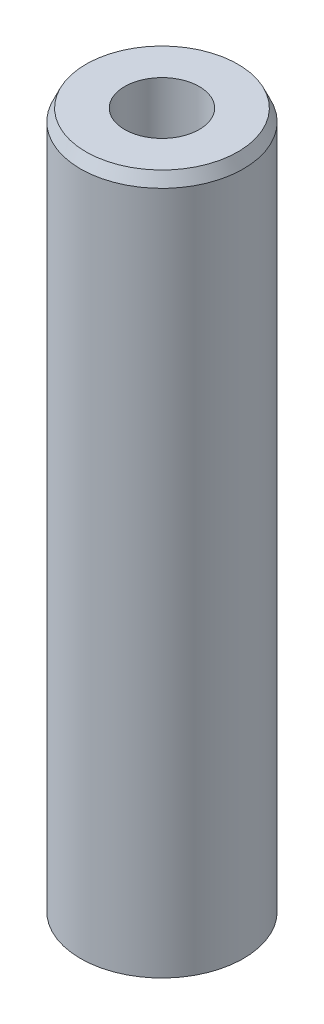
ISO-10303-21;
HEADER;
FILE_DESCRIPTION(('STEP AP214'),'2;1');
FILE_NAME('part.step','',(''),(''),'','','');
FILE_SCHEMA(('AUTOMOTIVE_DESIGN { 1 0 10303 214 1 1 1 1 }'));
ENDSEC;
DATA;
#1=APPLICATION_CONTEXT('core data for automotive mechanical design processes');
#2=APPLICATION_PROTOCOL_DEFINITION('international standard','automotive_design',2000,#1);
#3=PRODUCT_CONTEXT('',#1,'mechanical');
#4=PRODUCT('Part','Part','',(#3));
#5=PRODUCT_RELATED_PRODUCT_CATEGORY('part','',(#4));
#6=PRODUCT_DEFINITION_FORMATION('','',#4);
#7=PRODUCT_DEFINITION_CONTEXT('part definition',#1,'design');
#8=PRODUCT_DEFINITION('design','',#6,#7);
#9=PRODUCT_DEFINITION_SHAPE('','',#8);
#10=(LENGTH_UNIT() NAMED_UNIT(*) SI_UNIT(.MILLI.,.METRE.));
#11=(NAMED_UNIT(*) PLANE_ANGLE_UNIT() SI_UNIT($,.RADIAN.));
#12=(NAMED_UNIT(*) SI_UNIT($,.STERADIAN.) SOLID_ANGLE_UNIT());
#13=UNCERTAINTY_MEASURE_WITH_UNIT(LENGTH_MEASURE(1.E-05),#10,'distance_accuracy_value','');
#14=(GEOMETRIC_REPRESENTATION_CONTEXT(3) GLOBAL_UNCERTAINTY_ASSIGNED_CONTEXT((#13)) GLOBAL_UNIT_ASSIGNED_CONTEXT((#10,
#11,#12)) REPRESENTATION_CONTEXT('',''));
#15=CARTESIAN_POINT('',(0.,0.,0.));
#16=DIRECTION('',(0.,0.,1.));
#17=DIRECTION('',(1.,0.,0.));
#18=AXIS2_PLACEMENT_3D('',#15,#16,#17);
#19=CARTESIAN_POINT('',(0.,172.157615913995,0.));
#20=DIRECTION('',(0.,-1.,0.));
#21=DIRECTION('',(0.,0.,-1.));
#22=AXIS2_PLACEMENT_3D('',#19,#20,#21);
#23=CYLINDRICAL_SURFACE('',#22,20.);
#24=CARTESIAN_POINT('',(0.,169.214574288937,0.));
#25=DIRECTION('',(0.,1.,0.));
#26=DIRECTION('',(0.,0.,1.));
#27=AXIS2_PLACEMENT_3D('',#24,#25,#26);
#28=CIRCLE('',#27,20.);
#29=CARTESIAN_POINT('',(0.,169.214574288937,20.));
#30=VERTEX_POINT('',#29);
#31=EDGE_CURVE('E50',#30,#30,#28,.F.);
#32=ORIENTED_EDGE('',*,*,#31,.T.);
#33=EDGE_LOOP('',(#32));
#34=FACE_BOUND('',#33,.T.);
#35=CARTESIAN_POINT('',(0.,1.35440275397036,0.));
#36=DIRECTION('',(0.,1.,0.));
#37=DIRECTION('',(0.,0.,1.));
#38=AXIS2_PLACEMENT_3D('',#35,#36,#37);
#39=CIRCLE('',#38,20.);
#40=CARTESIAN_POINT('',(0.,1.35440275397036,20.));
#41=VERTEX_POINT('',#40);
#42=EDGE_CURVE('E51',#41,#41,#39,.T.);
#43=ORIENTED_EDGE('',*,*,#42,.T.);
#44=EDGE_LOOP('',(#43));
#45=FACE_BOUND('',#44,.T.);
#46=ADVANCED_FACE('F39',(#34,#45),#23,.T.);
#47=CARTESIAN_POINT('',(0.,172.157615913995,0.));
#48=DIRECTION('',(0.,1.,0.));
#49=DIRECTION('',(0.,0.,1.));
#50=AXIS2_PLACEMENT_3D('',#47,#48,#49);
#51=PLANE('',#50);
#52=CARTESIAN_POINT('',(0.,172.157615913995,0.));
#53=DIRECTION('',(0.,1.,0.));
#54=DIRECTION('',(0.,0.,1.));
#55=AXIS2_PLACEMENT_3D('',#52,#53,#54);
#56=CIRCLE('',#55,18.6455972460296);
#57=CARTESIAN_POINT('',(0.,172.157615913995,18.6455972460296));
#58=VERTEX_POINT('',#57);
#59=EDGE_CURVE('E54',#58,#58,#56,.T.);
#60=ORIENTED_EDGE('',*,*,#59,.T.);
#61=EDGE_LOOP('',(#60));
#62=FACE_BOUND('',#61,.T.);
#63=CARTESIAN_POINT('',(0.,172.157615913995,0.));
#64=DIRECTION('',(0.,1.,0.));
#65=DIRECTION('',(0.,0.,1.));
#66=AXIS2_PLACEMENT_3D('',#63,#64,#65);
#67=CIRCLE('',#66,9.1544376230129);
#68=CARTESIAN_POINT('',(0.,172.157615913995,9.1544376230129));
#69=VERTEX_POINT('',#68);
#70=EDGE_CURVE('E58',#69,#69,#67,.T.);
#71=ORIENTED_EDGE('',*,*,#70,.F.);
#72=EDGE_LOOP('',(#71));
#73=FACE_BOUND('',#72,.T.);
#74=ADVANCED_FACE('F69',(#62,#73),#51,.T.);
#75=CARTESIAN_POINT('',(0.,0.,0.));
#76=DIRECTION('',(0.,1.,0.));
#77=DIRECTION('',(0.,0.,1.));
#78=AXIS2_PLACEMENT_3D('',#75,#76,#77);
#79=PLANE('',#78);
#80=CARTESIAN_POINT('',(0.,0.,0.));
#81=DIRECTION('',(0.,1.,0.));
#82=DIRECTION('',(0.,0.,1.));
#83=AXIS2_PLACEMENT_3D('',#80,#81,#82);
#84=CIRCLE('',#83,17.0569583749421);
#85=CARTESIAN_POINT('',(0.,0.,17.0569583749421));
#86=VERTEX_POINT('',#85);
#87=EDGE_CURVE('E10',#86,#86,#84,.F.);
#88=ORIENTED_EDGE('',*,*,#87,.T.);
#89=EDGE_LOOP('',(#88));
#90=FACE_BOUND('',#89,.T.);
#91=CARTESIAN_POINT('',(0.,0.,0.));
#92=DIRECTION('',(0.,1.,0.));
#93=DIRECTION('',(0.,0.,1.));
#94=AXIS2_PLACEMENT_3D('',#91,#92,#93);
#95=CIRCLE('',#94,9.1544376230129);
#96=CARTESIAN_POINT('',(0.,0.,9.1544376230129));
#97=VERTEX_POINT('',#96);
#98=EDGE_CURVE('E63',#97,#97,#95,.T.);
#99=ORIENTED_EDGE('',*,*,#98,.T.);
#100=EDGE_LOOP('',(#99));
#101=FACE_BOUND('',#100,.T.);
#102=ADVANCED_FACE('F75',(#90,#101),#79,.F.);
#103=CARTESIAN_POINT('',(0.,172.157615913995,0.));
#104=DIRECTION('',(0.,-1.,0.));
#105=DIRECTION('',(0.,0.,-1.));
#106=AXIS2_PLACEMENT_3D('',#103,#104,#105);
#107=CYLINDRICAL_SURFACE('',#106,9.1544376230129);
#108=ORIENTED_EDGE('',*,*,#70,.T.);
#109=EDGE_LOOP('',(#108));
#110=FACE_BOUND('',#109,.T.);
#111=ORIENTED_EDGE('',*,*,#98,.F.);
#112=EDGE_LOOP('',(#111));
#113=FACE_BOUND('',#112,.T.);
#114=ADVANCED_FACE('F70',(#110,#113),#107,.F.);
#115=CARTESIAN_POINT('',(0.,172.157615913995,0.));
#116=DIRECTION('',(0.,-1.,0.));
#117=DIRECTION('',(0.,0.,-1.));
#118=AXIS2_PLACEMENT_3D('',#115,#116,#117);
#119=CONICAL_SURFACE('',#118,18.6455972460296,0.431308004632293);
#120=ORIENTED_EDGE('',*,*,#31,.F.);
#121=EDGE_LOOP('',(#120));
#122=FACE_BOUND('',#121,.T.);
#123=ORIENTED_EDGE('',*,*,#59,.F.);
#124=EDGE_LOOP('',(#123));
#125=FACE_BOUND('',#124,.T.);
#126=ADVANCED_FACE('F81',(#122,#125),#119,.T.);
#127=CARTESIAN_POINT('',(0.,1.35440275397036,0.));
#128=DIRECTION('',(0.,1.,0.));
#129=DIRECTION('',(0.,0.,1.));
#130=AXIS2_PLACEMENT_3D('',#127,#128,#129);
#131=CONICAL_SURFACE('',#130,20.,1.13948832216261);
#132=ORIENTED_EDGE('',*,*,#87,.F.);
#133=EDGE_LOOP('',(#132));
#134=FACE_BOUND('',#133,.T.);
#135=ORIENTED_EDGE('',*,*,#42,.F.);
#136=EDGE_LOOP('',(#135));
#137=FACE_BOUND('',#136,.T.);
#138=ADVANCED_FACE('F45',(#134,#137),#131,.T.);
#139=CLOSED_SHELL('',(#46,#74,#102,#114,#126,#138));
#140=MANIFOLD_SOLID_BREP('B2',#139);
#141=ADVANCED_BREP_SHAPE_REPRESENTATION('',(#18,#140),#14);
#142=SHAPE_DEFINITION_REPRESENTATION(#9,#141);
ENDSEC;
END-ISO-10303-21;
